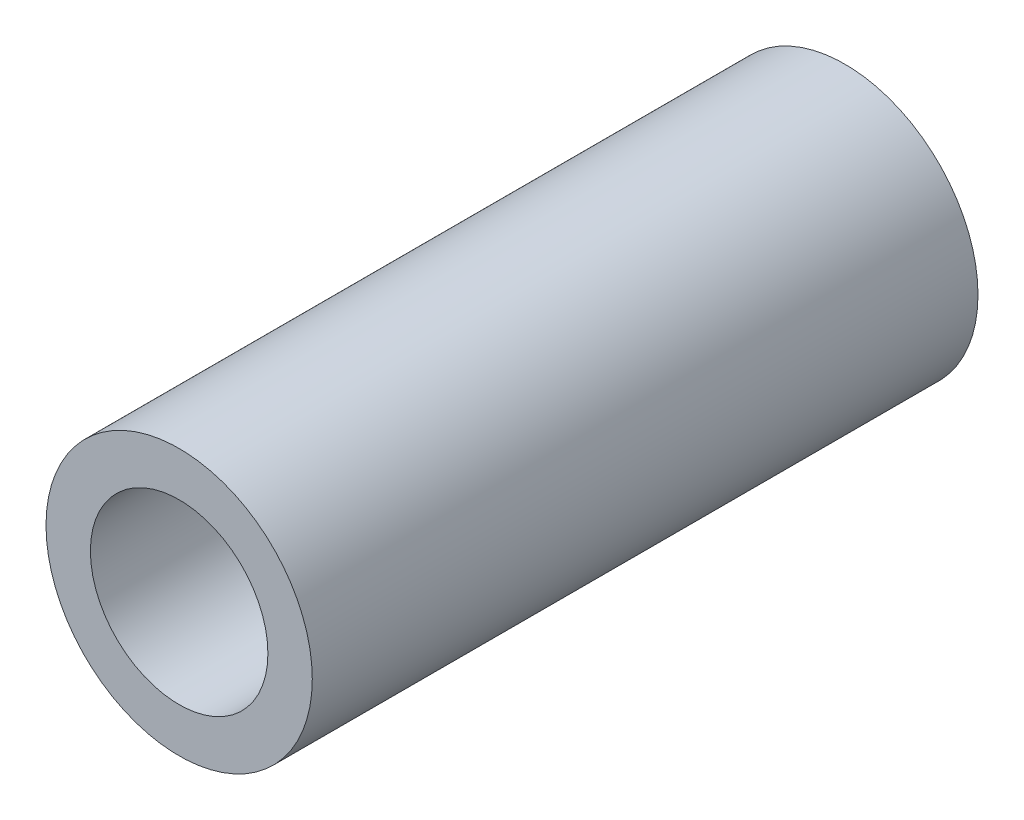
ISO-10303-21;
HEADER;
FILE_DESCRIPTION(('STEP AP214'),'2;1');
FILE_NAME('part.step','',(''),(''),'','','');
FILE_SCHEMA(('AUTOMOTIVE_DESIGN { 1 0 10303 214 1 1 1 1 }'));
ENDSEC;
DATA;
#1=APPLICATION_CONTEXT('core data for automotive mechanical design processes');
#2=APPLICATION_PROTOCOL_DEFINITION('international standard','automotive_design',2000,#1);
#3=PRODUCT_CONTEXT('',#1,'mechanical');
#4=PRODUCT('Part','Part','',(#3));
#5=PRODUCT_RELATED_PRODUCT_CATEGORY('part','',(#4));
#6=PRODUCT_DEFINITION_FORMATION('','',#4);
#7=PRODUCT_DEFINITION_CONTEXT('part definition',#1,'design');
#8=PRODUCT_DEFINITION('design','',#6,#7);
#9=PRODUCT_DEFINITION_SHAPE('','',#8);
#10=(LENGTH_UNIT() NAMED_UNIT(*) SI_UNIT(.MILLI.,.METRE.));
#11=(NAMED_UNIT(*) PLANE_ANGLE_UNIT() SI_UNIT($,.RADIAN.));
#12=(NAMED_UNIT(*) SI_UNIT($,.STERADIAN.) SOLID_ANGLE_UNIT());
#13=UNCERTAINTY_MEASURE_WITH_UNIT(LENGTH_MEASURE(1.E-05),#10,'distance_accuracy_value','');
#14=(GEOMETRIC_REPRESENTATION_CONTEXT(3) GLOBAL_UNCERTAINTY_ASSIGNED_CONTEXT((#13)) GLOBAL_UNIT_ASSIGNED_CONTEXT((#10,
#11,#12)) REPRESENTATION_CONTEXT('',''));
#15=CARTESIAN_POINT('',(0.,0.,0.));
#16=DIRECTION('',(0.,0.,1.));
#17=DIRECTION('',(1.,0.,0.));
#18=AXIS2_PLACEMENT_3D('',#15,#16,#17);
#19=CARTESIAN_POINT('',(0.,0.,38.1));
#20=DIRECTION('',(0.,0.,1.));
#21=DIRECTION('',(1.,0.,0.));
#22=AXIS2_PLACEMENT_3D('',#19,#20,#21);
#23=PLANE('',#22);
#24=CARTESIAN_POINT('',(0.,0.,38.1));
#25=DIRECTION('',(0.,0.,1.));
#26=DIRECTION('',(1.,0.,0.));
#27=AXIS2_PLACEMENT_3D('',#24,#25,#26);
#28=CIRCLE('',#27,7.62);
#29=CARTESIAN_POINT('',(7.62,0.,38.1));
#30=VERTEX_POINT('',#29);
#31=EDGE_CURVE('E10',#30,#30,#28,.T.);
#32=ORIENTED_EDGE('',*,*,#31,.T.);
#33=EDGE_LOOP('',(#32));
#34=FACE_BOUND('',#33,.T.);
#35=CARTESIAN_POINT('',(0.,0.,38.1));
#36=DIRECTION('',(0.,0.,1.));
#37=DIRECTION('',(1.,0.,0.));
#38=AXIS2_PLACEMENT_3D('',#35,#36,#37);
#39=CIRCLE('',#38,5.08);
#40=CARTESIAN_POINT('',(5.08,0.,38.1));
#41=VERTEX_POINT('',#40);
#42=EDGE_CURVE('E41',#41,#41,#39,.T.);
#43=ORIENTED_EDGE('',*,*,#42,.F.);
#44=EDGE_LOOP('',(#43));
#45=FACE_BOUND('',#44,.T.);
#46=ADVANCED_FACE('F30',(#34,#45),#23,.T.);
#47=CARTESIAN_POINT('',(0.,0.,0.));
#48=DIRECTION('',(0.,0.,1.));
#49=DIRECTION('',(1.,0.,0.));
#50=AXIS2_PLACEMENT_3D('',#47,#48,#49);
#51=PLANE('',#50);
#52=CARTESIAN_POINT('',(0.,0.,0.));
#53=DIRECTION('',(0.,0.,1.));
#54=DIRECTION('',(1.,0.,0.));
#55=AXIS2_PLACEMENT_3D('',#52,#53,#54);
#56=CIRCLE('',#55,7.62);
#57=CARTESIAN_POINT('',(7.62,0.,0.));
#58=VERTEX_POINT('',#57);
#59=EDGE_CURVE('E34',#58,#58,#56,.T.);
#60=ORIENTED_EDGE('',*,*,#59,.F.);
#61=EDGE_LOOP('',(#60));
#62=FACE_BOUND('',#61,.T.);
#63=CARTESIAN_POINT('',(0.,0.,0.));
#64=DIRECTION('',(0.,0.,1.));
#65=DIRECTION('',(1.,0.,0.));
#66=AXIS2_PLACEMENT_3D('',#63,#64,#65);
#67=CIRCLE('',#66,5.08);
#68=CARTESIAN_POINT('',(5.08,0.,0.));
#69=VERTEX_POINT('',#68);
#70=EDGE_CURVE('E43',#69,#69,#67,.T.);
#71=ORIENTED_EDGE('',*,*,#70,.T.);
#72=EDGE_LOOP('',(#71));
#73=FACE_BOUND('',#72,.T.);
#74=ADVANCED_FACE('F53',(#62,#73),#51,.F.);
#75=CARTESIAN_POINT('',(0.,0.,38.1));
#76=DIRECTION('',(0.,0.,-1.));
#77=DIRECTION('',(-1.,0.,0.));
#78=AXIS2_PLACEMENT_3D('',#75,#76,#77);
#79=CYLINDRICAL_SURFACE('',#78,7.62);
#80=ORIENTED_EDGE('',*,*,#31,.F.);
#81=EDGE_LOOP('',(#80));
#82=FACE_BOUND('',#81,.T.);
#83=ORIENTED_EDGE('',*,*,#59,.T.);
#84=EDGE_LOOP('',(#83));
#85=FACE_BOUND('',#84,.T.);
#86=ADVANCED_FACE('F32',(#82,#85),#79,.T.);
#87=CARTESIAN_POINT('',(0.,0.,38.1));
#88=DIRECTION('',(0.,0.,-1.));
#89=DIRECTION('',(-1.,0.,0.));
#90=AXIS2_PLACEMENT_3D('',#87,#88,#89);
#91=CYLINDRICAL_SURFACE('',#90,5.08);
#92=ORIENTED_EDGE('',*,*,#42,.T.);
#93=EDGE_LOOP('',(#92));
#94=FACE_BOUND('',#93,.T.);
#95=ORIENTED_EDGE('',*,*,#70,.F.);
#96=EDGE_LOOP('',(#95));
#97=FACE_BOUND('',#96,.T.);
#98=ADVANCED_FACE('F49',(#94,#97),#91,.F.);
#99=CLOSED_SHELL('',(#46,#74,#86,#98));
#100=MANIFOLD_SOLID_BREP('B2',#99);
#101=ADVANCED_BREP_SHAPE_REPRESENTATION('',(#18,#100),#14);
#102=SHAPE_DEFINITION_REPRESENTATION(#9,#101);
ENDSEC;
END-ISO-10303-21;
